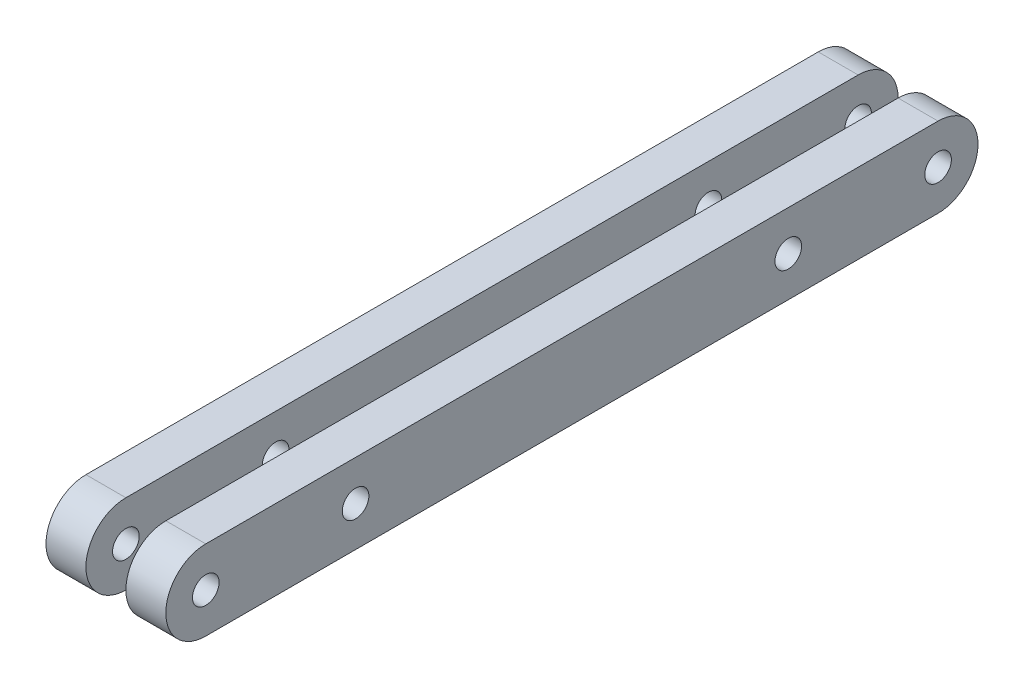
ISO-10303-21;
HEADER;
FILE_DESCRIPTION(('STEP AP214'),'2;1');
FILE_NAME('part.step','',(''),(''),'','','');
FILE_SCHEMA(('AUTOMOTIVE_DESIGN { 1 0 10303 214 1 1 1 1 }'));
ENDSEC;
DATA;
#1=APPLICATION_CONTEXT('core data for automotive mechanical design processes');
#2=APPLICATION_PROTOCOL_DEFINITION('international standard','automotive_design',2000,#1);
#3=PRODUCT_CONTEXT('',#1,'mechanical');
#4=PRODUCT('Part','Part','',(#3));
#5=PRODUCT_RELATED_PRODUCT_CATEGORY('part','',(#4));
#6=PRODUCT_DEFINITION_FORMATION('','',#4);
#7=PRODUCT_DEFINITION_CONTEXT('part definition',#1,'design');
#8=PRODUCT_DEFINITION('design','',#6,#7);
#9=PRODUCT_DEFINITION_SHAPE('','',#8);
#10=(LENGTH_UNIT() NAMED_UNIT(*) SI_UNIT(.MILLI.,.METRE.));
#11=(NAMED_UNIT(*) PLANE_ANGLE_UNIT() SI_UNIT($,.RADIAN.));
#12=(NAMED_UNIT(*) SI_UNIT($,.STERADIAN.) SOLID_ANGLE_UNIT());
#13=UNCERTAINTY_MEASURE_WITH_UNIT(LENGTH_MEASURE(1.E-05),#10,'distance_accuracy_value','');
#14=(GEOMETRIC_REPRESENTATION_CONTEXT(3) GLOBAL_UNCERTAINTY_ASSIGNED_CONTEXT((#13)) GLOBAL_UNIT_ASSIGNED_CONTEXT((#10,
#11,#12)) REPRESENTATION_CONTEXT('',''));
#15=CARTESIAN_POINT('',(0.,0.,0.));
#16=DIRECTION('',(0.,0.,1.));
#17=DIRECTION('',(1.,0.,0.));
#18=AXIS2_PLACEMENT_3D('',#15,#16,#17);
#19=CARTESIAN_POINT('',(-9.,0.,0.));
#20=DIRECTION('',(1.,0.,0.));
#21=DIRECTION('',(0.,0.,1.));
#22=AXIS2_PLACEMENT_3D('',#19,#20,#21);
#23=CYLINDRICAL_SURFACE('',#22,6.);
#24=CARTESIAN_POINT('',(-3.,0.,0.));
#25=DIRECTION('',(1.,0.,0.));
#26=DIRECTION('',(0.,0.,-1.));
#27=AXIS2_PLACEMENT_3D('',#24,#25,#26);
#28=CIRCLE('',#27,6.);
#29=CARTESIAN_POINT('',(-3.,6.,0.));
#30=VERTEX_POINT('',#29);
#31=CARTESIAN_POINT('',(-3.,-6.,0.));
#32=VERTEX_POINT('',#31);
#33=EDGE_CURVE('E116',#30,#32,#28,.T.);
#34=ORIENTED_EDGE('',*,*,#33,.F.);
#35=DIRECTION('',(1.,0.,0.));
#36=VECTOR('',#35,1.);
#37=CARTESIAN_POINT('',(-9.,6.,0.));
#38=LINE('',#37,#36);
#39=CARTESIAN_POINT('',(-9.,6.,0.));
#40=VERTEX_POINT('',#39);
#41=EDGE_CURVE('E115',#40,#30,#38,.T.);
#42=ORIENTED_EDGE('',*,*,#41,.F.);
#43=CARTESIAN_POINT('',(-9.,0.,0.));
#44=DIRECTION('',(1.,0.,0.));
#45=DIRECTION('',(0.,0.,-1.));
#46=AXIS2_PLACEMENT_3D('',#43,#44,#45);
#47=CIRCLE('',#46,6.);
#48=CARTESIAN_POINT('',(-9.,-6.,0.));
#49=VERTEX_POINT('',#48);
#50=EDGE_CURVE('E109',#40,#49,#47,.T.);
#51=ORIENTED_EDGE('',*,*,#50,.T.);
#52=DIRECTION('',(1.,0.,0.));
#53=VECTOR('',#52,1.);
#54=CARTESIAN_POINT('',(-9.,-6.,0.));
#55=LINE('',#54,#53);
#56=EDGE_CURVE('E12',#49,#32,#55,.T.);
#57=ORIENTED_EDGE('',*,*,#56,.T.);
#58=EDGE_LOOP('',(#34,#42,#51,#57));
#59=FACE_BOUND('',#58,.T.);
#60=ADVANCED_FACE('F49',(#59),#23,.T.);
#61=CARTESIAN_POINT('',(-9.,-6.,0.));
#62=DIRECTION('',(0.,1.,0.));
#63=DIRECTION('',(0.,0.,1.));
#64=AXIS2_PLACEMENT_3D('',#61,#62,#63);
#65=PLANE('',#64);
#66=DIRECTION('',(0.,0.,-1.));
#67=VECTOR('',#66,1.);
#68=CARTESIAN_POINT('',(-3.,-6.,0.));
#69=LINE('',#68,#67);
#70=CARTESIAN_POINT('',(-3.,-6.,-110.));
#71=VERTEX_POINT('',#70);
#72=EDGE_CURVE('E118',#32,#71,#69,.T.);
#73=ORIENTED_EDGE('',*,*,#72,.F.);
#74=ORIENTED_EDGE('',*,*,#56,.F.);
#75=DIRECTION('',(0.,0.,-1.));
#76=VECTOR('',#75,1.);
#77=CARTESIAN_POINT('',(-9.,-6.,0.));
#78=LINE('',#77,#76);
#79=CARTESIAN_POINT('',(-9.,-6.,-110.));
#80=VERTEX_POINT('',#79);
#81=EDGE_CURVE('E92',#49,#80,#78,.T.);
#82=ORIENTED_EDGE('',*,*,#81,.T.);
#83=DIRECTION('',(1.,0.,0.));
#84=VECTOR('',#83,1.);
#85=CARTESIAN_POINT('',(-9.,-6.,-110.));
#86=LINE('',#85,#84);
#87=EDGE_CURVE('E58',#80,#71,#86,.T.);
#88=ORIENTED_EDGE('',*,*,#87,.T.);
#89=EDGE_LOOP('',(#73,#74,#82,#88));
#90=FACE_BOUND('',#89,.T.);
#91=ADVANCED_FACE('F107',(#90),#65,.F.);
#92=CARTESIAN_POINT('',(-9.,0.,-110.));
#93=DIRECTION('',(1.,0.,0.));
#94=DIRECTION('',(0.,0.,1.));
#95=AXIS2_PLACEMENT_3D('',#92,#93,#94);
#96=CYLINDRICAL_SURFACE('',#95,6.);
#97=CARTESIAN_POINT('',(-3.,0.,-110.));
#98=DIRECTION('',(1.,0.,0.));
#99=DIRECTION('',(0.,0.,-1.));
#100=AXIS2_PLACEMENT_3D('',#97,#98,#99);
#101=CIRCLE('',#100,6.);
#102=CARTESIAN_POINT('',(-3.,6.,-110.));
#103=VERTEX_POINT('',#102);
#104=EDGE_CURVE('E102',#71,#103,#101,.T.);
#105=ORIENTED_EDGE('',*,*,#104,.F.);
#106=ORIENTED_EDGE('',*,*,#87,.F.);
#107=CARTESIAN_POINT('',(-9.,0.,-110.));
#108=DIRECTION('',(1.,0.,0.));
#109=DIRECTION('',(0.,0.,-1.));
#110=AXIS2_PLACEMENT_3D('',#107,#108,#109);
#111=CIRCLE('',#110,6.);
#112=CARTESIAN_POINT('',(-9.,6.,-110.));
#113=VERTEX_POINT('',#112);
#114=EDGE_CURVE('E95',#80,#113,#111,.T.);
#115=ORIENTED_EDGE('',*,*,#114,.T.);
#116=DIRECTION('',(1.,0.,0.));
#117=VECTOR('',#116,1.);
#118=CARTESIAN_POINT('',(-9.,6.,-110.));
#119=LINE('',#118,#117);
#120=EDGE_CURVE('E105',#113,#103,#119,.T.);
#121=ORIENTED_EDGE('',*,*,#120,.T.);
#122=EDGE_LOOP('',(#105,#106,#115,#121));
#123=FACE_BOUND('',#122,.T.);
#124=ADVANCED_FACE('F101',(#123),#96,.T.);
#125=CARTESIAN_POINT('',(-9.,6.,0.));
#126=DIRECTION('',(0.,1.,0.));
#127=DIRECTION('',(0.,0.,1.));
#128=AXIS2_PLACEMENT_3D('',#125,#126,#127);
#129=PLANE('',#128);
#130=DIRECTION('',(0.,0.,-1.));
#131=VECTOR('',#130,1.);
#132=CARTESIAN_POINT('',(-3.,6.,0.));
#133=LINE('',#132,#131);
#134=EDGE_CURVE('E81',#30,#103,#133,.T.);
#135=ORIENTED_EDGE('',*,*,#134,.T.);
#136=ORIENTED_EDGE('',*,*,#120,.F.);
#137=DIRECTION('',(0.,0.,-1.));
#138=VECTOR('',#137,1.);
#139=CARTESIAN_POINT('',(-9.,6.,0.));
#140=LINE('',#139,#138);
#141=EDGE_CURVE('E67',#40,#113,#140,.T.);
#142=ORIENTED_EDGE('',*,*,#141,.F.);
#143=ORIENTED_EDGE('',*,*,#41,.T.);
#144=EDGE_LOOP('',(#135,#136,#142,#143));
#145=FACE_BOUND('',#144,.T.);
#146=ADVANCED_FACE('F167',(#145),#129,.T.);
#147=CARTESIAN_POINT('',(-9.,0.,0.));
#148=DIRECTION('',(-1.,0.,0.));
#149=DIRECTION('',(0.,0.,-1.));
#150=AXIS2_PLACEMENT_3D('',#147,#148,#149);
#151=PLANE('',#150);
#152=CARTESIAN_POINT('',(-9.,0.,-87.5));
#153=DIRECTION('',(1.,0.,0.));
#154=DIRECTION('',(0.,0.,-1.));
#155=AXIS2_PLACEMENT_3D('',#152,#153,#154);
#156=CIRCLE('',#155,2.);
#157=CARTESIAN_POINT('',(-9.,0.,-89.5));
#158=VERTEX_POINT('',#157);
#159=EDGE_CURVE('E138',#158,#158,#156,.T.);
#160=ORIENTED_EDGE('',*,*,#159,.T.);
#161=EDGE_LOOP('',(#160));
#162=FACE_BOUND('',#161,.T.);
#163=CARTESIAN_POINT('',(-9.,0.,-22.5));
#164=DIRECTION('',(1.,0.,0.));
#165=DIRECTION('',(0.,0.,-1.));
#166=AXIS2_PLACEMENT_3D('',#163,#164,#165);
#167=CIRCLE('',#166,2.);
#168=CARTESIAN_POINT('',(-9.,0.,-24.5));
#169=VERTEX_POINT('',#168);
#170=EDGE_CURVE('E127',#169,#169,#167,.T.);
#171=ORIENTED_EDGE('',*,*,#170,.T.);
#172=EDGE_LOOP('',(#171));
#173=FACE_BOUND('',#172,.T.);
#174=CARTESIAN_POINT('',(-9.,0.,0.));
#175=DIRECTION('',(1.,0.,0.));
#176=DIRECTION('',(0.,0.,-1.));
#177=AXIS2_PLACEMENT_3D('',#174,#175,#176);
#178=CIRCLE('',#177,2.00000000000001);
#179=CARTESIAN_POINT('',(-9.,0.,-2.00000000000001));
#180=VERTEX_POINT('',#179);
#181=EDGE_CURVE('E119',#180,#180,#178,.T.);
#182=ORIENTED_EDGE('',*,*,#181,.T.);
#183=EDGE_LOOP('',(#182));
#184=FACE_BOUND('',#183,.T.);
#185=CARTESIAN_POINT('',(-9.,0.,-110.));
#186=DIRECTION('',(1.,0.,0.));
#187=DIRECTION('',(0.,0.,-1.));
#188=AXIS2_PLACEMENT_3D('',#185,#186,#187);
#189=CIRCLE('',#188,2.);
#190=CARTESIAN_POINT('',(-9.,0.,-112.));
#191=VERTEX_POINT('',#190);
#192=EDGE_CURVE('E142',#191,#191,#189,.T.);
#193=ORIENTED_EDGE('',*,*,#192,.T.);
#194=EDGE_LOOP('',(#193));
#195=FACE_BOUND('',#194,.T.);
#196=ORIENTED_EDGE('',*,*,#50,.F.);
#197=ORIENTED_EDGE('',*,*,#141,.T.);
#198=ORIENTED_EDGE('',*,*,#114,.F.);
#199=ORIENTED_EDGE('',*,*,#81,.F.);
#200=EDGE_LOOP('',(#196,#197,#198,#199));
#201=FACE_BOUND('',#200,.T.);
#202=ADVANCED_FACE('F97',(#162,#173,#184,#195,#201),#151,.T.);
#203=CARTESIAN_POINT('',(-3.,0.,0.));
#204=DIRECTION('',(-1.,0.,0.));
#205=DIRECTION('',(0.,0.,-1.));
#206=AXIS2_PLACEMENT_3D('',#203,#204,#205);
#207=PLANE('',#206);
#208=CARTESIAN_POINT('',(-3.,0.,-87.5));
#209=DIRECTION('',(-1.,0.,0.));
#210=DIRECTION('',(0.,0.,1.));
#211=AXIS2_PLACEMENT_3D('',#208,#209,#210);
#212=CIRCLE('',#211,2.);
#213=CARTESIAN_POINT('',(-3.,0.,-85.5));
#214=VERTEX_POINT('',#213);
#215=EDGE_CURVE('E52',#214,#214,#212,.T.);
#216=ORIENTED_EDGE('',*,*,#215,.T.);
#217=EDGE_LOOP('',(#216));
#218=FACE_BOUND('',#217,.T.);
#219=CARTESIAN_POINT('',(-3.,0.,-22.5));
#220=DIRECTION('',(-1.,0.,0.));
#221=DIRECTION('',(0.,0.,1.));
#222=AXIS2_PLACEMENT_3D('',#219,#220,#221);
#223=CIRCLE('',#222,2.);
#224=CARTESIAN_POINT('',(-3.,0.,-20.5));
#225=VERTEX_POINT('',#224);
#226=EDGE_CURVE('E124',#225,#225,#223,.T.);
#227=ORIENTED_EDGE('',*,*,#226,.T.);
#228=EDGE_LOOP('',(#227));
#229=FACE_BOUND('',#228,.T.);
#230=CARTESIAN_POINT('',(-3.,0.,0.));
#231=DIRECTION('',(1.,0.,0.));
#232=DIRECTION('',(0.,0.,-1.));
#233=AXIS2_PLACEMENT_3D('',#230,#231,#232);
#234=CIRCLE('',#233,2.00000000000001);
#235=CARTESIAN_POINT('',(-3.,0.,-2.00000000000001));
#236=VERTEX_POINT('',#235);
#237=EDGE_CURVE('E131',#236,#236,#234,.T.);
#238=ORIENTED_EDGE('',*,*,#237,.F.);
#239=EDGE_LOOP('',(#238));
#240=FACE_BOUND('',#239,.T.);
#241=CARTESIAN_POINT('',(-3.,0.,-110.));
#242=DIRECTION('',(1.,0.,0.));
#243=DIRECTION('',(0.,0.,-1.));
#244=AXIS2_PLACEMENT_3D('',#241,#242,#243);
#245=CIRCLE('',#244,2.);
#246=CARTESIAN_POINT('',(-3.,0.,-112.));
#247=VERTEX_POINT('',#246);
#248=EDGE_CURVE('E126',#247,#247,#245,.T.);
#249=ORIENTED_EDGE('',*,*,#248,.F.);
#250=EDGE_LOOP('',(#249));
#251=FACE_BOUND('',#250,.T.);
#252=ORIENTED_EDGE('',*,*,#33,.T.);
#253=ORIENTED_EDGE('',*,*,#72,.T.);
#254=ORIENTED_EDGE('',*,*,#104,.T.);
#255=ORIENTED_EDGE('',*,*,#134,.F.);
#256=EDGE_LOOP('',(#252,#253,#254,#255));
#257=FACE_BOUND('',#256,.T.);
#258=ADVANCED_FACE('F158',(#218,#229,#240,#251,#257),#207,.F.);
#259=CARTESIAN_POINT('',(-3.,0.,-110.));
#260=DIRECTION('',(-1.,0.,0.));
#261=DIRECTION('',(0.,0.,-1.));
#262=AXIS2_PLACEMENT_3D('',#259,#260,#261);
#263=CYLINDRICAL_SURFACE('',#262,2.);
#264=ORIENTED_EDGE('',*,*,#192,.F.);
#265=EDGE_LOOP('',(#264));
#266=FACE_BOUND('',#265,.T.);
#267=ORIENTED_EDGE('',*,*,#248,.T.);
#268=EDGE_LOOP('',(#267));
#269=FACE_BOUND('',#268,.T.);
#270=ADVANCED_FACE('F154',(#266,#269),#263,.F.);
#271=CARTESIAN_POINT('',(-3.,0.,0.));
#272=DIRECTION('',(-1.,0.,0.));
#273=DIRECTION('',(0.,0.,-1.));
#274=AXIS2_PLACEMENT_3D('',#271,#272,#273);
#275=CYLINDRICAL_SURFACE('',#274,2.00000000000001);
#276=ORIENTED_EDGE('',*,*,#181,.F.);
#277=EDGE_LOOP('',(#276));
#278=FACE_BOUND('',#277,.T.);
#279=ORIENTED_EDGE('',*,*,#237,.T.);
#280=EDGE_LOOP('',(#279));
#281=FACE_BOUND('',#280,.T.);
#282=ADVANCED_FACE('F150',(#278,#281),#275,.F.);
#283=CARTESIAN_POINT('',(9.,0.,-22.5));
#284=DIRECTION('',(1.,0.,0.));
#285=DIRECTION('',(0.,0.,-1.));
#286=AXIS2_PLACEMENT_3D('',#283,#284,#285);
#287=CYLINDRICAL_SURFACE('',#286,2.);
#288=ORIENTED_EDGE('',*,*,#170,.F.);
#289=EDGE_LOOP('',(#288));
#290=FACE_BOUND('',#289,.T.);
#291=ORIENTED_EDGE('',*,*,#226,.F.);
#292=EDGE_LOOP('',(#291));
#293=FACE_BOUND('',#292,.T.);
#294=ADVANCED_FACE('F153',(#290,#293),#287,.F.);
#295=CARTESIAN_POINT('',(9.,0.,-87.5));
#296=DIRECTION('',(1.,0.,0.));
#297=DIRECTION('',(0.,0.,-1.));
#298=AXIS2_PLACEMENT_3D('',#295,#296,#297);
#299=CYLINDRICAL_SURFACE('',#298,2.);
#300=ORIENTED_EDGE('',*,*,#159,.F.);
#301=EDGE_LOOP('',(#300));
#302=FACE_BOUND('',#301,.T.);
#303=ORIENTED_EDGE('',*,*,#215,.F.);
#304=EDGE_LOOP('',(#303));
#305=FACE_BOUND('',#304,.T.);
#306=ADVANCED_FACE('F230',(#302,#305),#299,.F.);
#307=CLOSED_SHELL('',(#60,#91,#124,#146,#202,#258,#270,#282,#294,#306));
#308=MANIFOLD_SOLID_BREP('B2',#307);
#309=CARTESIAN_POINT('',(9.,0.,0.));
#310=DIRECTION('',(-1.,0.,0.));
#311=DIRECTION('',(0.,0.,1.));
#312=AXIS2_PLACEMENT_3D('',#309,#310,#311);
#313=CYLINDRICAL_SURFACE('',#312,6.);
#314=CARTESIAN_POINT('',(3.,0.,0.));
#315=DIRECTION('',(1.,0.,0.));
#316=DIRECTION('',(0.,0.,-1.));
#317=AXIS2_PLACEMENT_3D('',#314,#315,#316);
#318=CIRCLE('',#317,6.);
#319=CARTESIAN_POINT('',(3.,6.,0.));
#320=VERTEX_POINT('',#319);
#321=CARTESIAN_POINT('',(3.,-6.,0.));
#322=VERTEX_POINT('',#321);
#323=EDGE_CURVE('E322',#320,#322,#318,.T.);
#324=ORIENTED_EDGE('',*,*,#323,.T.);
#325=DIRECTION('',(-1.,0.,0.));
#326=VECTOR('',#325,1.);
#327=CARTESIAN_POINT('',(9.,-6.,0.));
#328=LINE('',#327,#326);
#329=CARTESIAN_POINT('',(9.,-6.,0.));
#330=VERTEX_POINT('',#329);
#331=EDGE_CURVE('E47',#330,#322,#328,.T.);
#332=ORIENTED_EDGE('',*,*,#331,.F.);
#333=CARTESIAN_POINT('',(9.,0.,0.));
#334=DIRECTION('',(1.,0.,0.));
#335=DIRECTION('',(0.,0.,-1.));
#336=AXIS2_PLACEMENT_3D('',#333,#334,#335);
#337=CIRCLE('',#336,6.);
#338=CARTESIAN_POINT('',(9.,6.,0.));
#339=VERTEX_POINT('',#338);
#340=EDGE_CURVE('E307',#339,#330,#337,.T.);
#341=ORIENTED_EDGE('',*,*,#340,.F.);
#342=DIRECTION('',(-1.,0.,0.));
#343=VECTOR('',#342,1.);
#344=CARTESIAN_POINT('',(9.,6.,0.));
#345=LINE('',#344,#343);
#346=EDGE_CURVE('E274',#339,#320,#345,.T.);
#347=ORIENTED_EDGE('',*,*,#346,.T.);
#348=EDGE_LOOP('',(#324,#332,#341,#347));
#349=FACE_BOUND('',#348,.T.);
#350=ADVANCED_FACE('F257',(#349),#313,.T.);
#351=CARTESIAN_POINT('',(9.,-6.,0.));
#352=DIRECTION('',(0.,1.,0.));
#353=DIRECTION('',(0.,0.,1.));
#354=AXIS2_PLACEMENT_3D('',#351,#352,#353);
#355=PLANE('',#354);
#356=DIRECTION('',(0.,0.,-1.));
#357=VECTOR('',#356,1.);
#358=CARTESIAN_POINT('',(3.,-6.,0.));
#359=LINE('',#358,#357);
#360=CARTESIAN_POINT('',(3.,-6.,-110.));
#361=VERTEX_POINT('',#360);
#362=EDGE_CURVE('E312',#322,#361,#359,.T.);
#363=ORIENTED_EDGE('',*,*,#362,.T.);
#364=DIRECTION('',(-1.,0.,0.));
#365=VECTOR('',#364,1.);
#366=CARTESIAN_POINT('',(9.,-6.,-110.));
#367=LINE('',#366,#365);
#368=CARTESIAN_POINT('',(9.,-6.,-110.));
#369=VERTEX_POINT('',#368);
#370=EDGE_CURVE('E266',#369,#361,#367,.T.);
#371=ORIENTED_EDGE('',*,*,#370,.F.);
#372=DIRECTION('',(0.,0.,-1.));
#373=VECTOR('',#372,1.);
#374=CARTESIAN_POINT('',(9.,-6.,0.));
#375=LINE('',#374,#373);
#376=EDGE_CURVE('E300',#330,#369,#375,.T.);
#377=ORIENTED_EDGE('',*,*,#376,.F.);
#378=ORIENTED_EDGE('',*,*,#331,.T.);
#379=EDGE_LOOP('',(#363,#371,#377,#378));
#380=FACE_BOUND('',#379,.T.);
#381=ADVANCED_FACE('F311',(#380),#355,.F.);
#382=CARTESIAN_POINT('',(9.,0.,-110.));
#383=DIRECTION('',(-1.,0.,0.));
#384=DIRECTION('',(0.,0.,1.));
#385=AXIS2_PLACEMENT_3D('',#382,#383,#384);
#386=CYLINDRICAL_SURFACE('',#385,6.);
#387=CARTESIAN_POINT('',(3.,0.,-110.));
#388=DIRECTION('',(1.,0.,0.));
#389=DIRECTION('',(0.,0.,-1.));
#390=AXIS2_PLACEMENT_3D('',#387,#388,#389);
#391=CIRCLE('',#390,6.);
#392=CARTESIAN_POINT('',(3.,6.,-110.));
#393=VERTEX_POINT('',#392);
#394=EDGE_CURVE('E326',#361,#393,#391,.T.);
#395=ORIENTED_EDGE('',*,*,#394,.T.);
#396=DIRECTION('',(-1.,0.,0.));
#397=VECTOR('',#396,1.);
#398=CARTESIAN_POINT('',(9.,6.,-110.));
#399=LINE('',#398,#397);
#400=CARTESIAN_POINT('',(9.,6.,-110.));
#401=VERTEX_POINT('',#400);
#402=EDGE_CURVE('E289',#401,#393,#399,.T.);
#403=ORIENTED_EDGE('',*,*,#402,.F.);
#404=CARTESIAN_POINT('',(9.,0.,-110.));
#405=DIRECTION('',(1.,0.,0.));
#406=DIRECTION('',(0.,0.,-1.));
#407=AXIS2_PLACEMENT_3D('',#404,#405,#406);
#408=CIRCLE('',#407,6.);
#409=EDGE_CURVE('E306',#369,#401,#408,.T.);
#410=ORIENTED_EDGE('',*,*,#409,.F.);
#411=ORIENTED_EDGE('',*,*,#370,.T.);
#412=EDGE_LOOP('',(#395,#403,#410,#411));
#413=FACE_BOUND('',#412,.T.);
#414=ADVANCED_FACE('F316',(#413),#386,.T.);
#415=CARTESIAN_POINT('',(9.,6.,0.));
#416=DIRECTION('',(0.,1.,0.));
#417=DIRECTION('',(0.,0.,1.));
#418=AXIS2_PLACEMENT_3D('',#415,#416,#417);
#419=PLANE('',#418);
#420=DIRECTION('',(0.,0.,-1.));
#421=VECTOR('',#420,1.);
#422=CARTESIAN_POINT('',(3.,6.,0.));
#423=LINE('',#422,#421);
#424=EDGE_CURVE('E328',#320,#393,#423,.T.);
#425=ORIENTED_EDGE('',*,*,#424,.F.);
#426=ORIENTED_EDGE('',*,*,#346,.F.);
#427=DIRECTION('',(0.,0.,-1.));
#428=VECTOR('',#427,1.);
#429=CARTESIAN_POINT('',(9.,6.,0.));
#430=LINE('',#429,#428);
#431=EDGE_CURVE('E317',#339,#401,#430,.T.);
#432=ORIENTED_EDGE('',*,*,#431,.T.);
#433=ORIENTED_EDGE('',*,*,#402,.T.);
#434=EDGE_LOOP('',(#425,#426,#432,#433));
#435=FACE_BOUND('',#434,.T.);
#436=ADVANCED_FACE('F375',(#435),#419,.T.);
#437=CARTESIAN_POINT('',(9.,0.,0.));
#438=DIRECTION('',(1.,0.,0.));
#439=DIRECTION('',(0.,0.,-1.));
#440=AXIS2_PLACEMENT_3D('',#437,#438,#439);
#441=PLANE('',#440);
#442=CARTESIAN_POINT('',(9.,0.,-87.5));
#443=DIRECTION('',(1.,0.,0.));
#444=DIRECTION('',(0.,0.,-1.));
#445=AXIS2_PLACEMENT_3D('',#442,#443,#444);
#446=CIRCLE('',#445,2.);
#447=CARTESIAN_POINT('',(9.,0.,-89.5));
#448=VERTEX_POINT('',#447);
#449=EDGE_CURVE('E351',#448,#448,#446,.T.);
#450=ORIENTED_EDGE('',*,*,#449,.F.);
#451=EDGE_LOOP('',(#450));
#452=FACE_BOUND('',#451,.T.);
#453=CARTESIAN_POINT('',(9.,0.,-22.5));
#454=DIRECTION('',(1.,0.,0.));
#455=DIRECTION('',(0.,0.,-1.));
#456=AXIS2_PLACEMENT_3D('',#453,#454,#455);
#457=CIRCLE('',#456,2.);
#458=CARTESIAN_POINT('',(9.,0.,-24.5));
#459=VERTEX_POINT('',#458);
#460=EDGE_CURVE('E348',#459,#459,#457,.T.);
#461=ORIENTED_EDGE('',*,*,#460,.F.);
#462=EDGE_LOOP('',(#461));
#463=FACE_BOUND('',#462,.T.);
#464=CARTESIAN_POINT('',(9.,0.,0.));
#465=DIRECTION('',(1.,0.,0.));
#466=DIRECTION('',(0.,0.,-1.));
#467=AXIS2_PLACEMENT_3D('',#464,#465,#466);
#468=CIRCLE('',#467,2.00000000000001);
#469=CARTESIAN_POINT('',(9.,0.,-2.00000000000001));
#470=VERTEX_POINT('',#469);
#471=EDGE_CURVE('E324',#470,#470,#468,.T.);
#472=ORIENTED_EDGE('',*,*,#471,.F.);
#473=EDGE_LOOP('',(#472));
#474=FACE_BOUND('',#473,.T.);
#475=CARTESIAN_POINT('',(9.,0.,-110.));
#476=DIRECTION('',(1.,0.,0.));
#477=DIRECTION('',(0.,0.,-1.));
#478=AXIS2_PLACEMENT_3D('',#475,#476,#477);
#479=CIRCLE('',#478,2.);
#480=CARTESIAN_POINT('',(9.,0.,-112.));
#481=VERTEX_POINT('',#480);
#482=EDGE_CURVE('E336',#481,#481,#479,.T.);
#483=ORIENTED_EDGE('',*,*,#482,.F.);
#484=EDGE_LOOP('',(#483));
#485=FACE_BOUND('',#484,.T.);
#486=ORIENTED_EDGE('',*,*,#340,.T.);
#487=ORIENTED_EDGE('',*,*,#376,.T.);
#488=ORIENTED_EDGE('',*,*,#409,.T.);
#489=ORIENTED_EDGE('',*,*,#431,.F.);
#490=EDGE_LOOP('',(#486,#487,#488,#489));
#491=FACE_BOUND('',#490,.T.);
#492=ADVANCED_FACE('F303',(#452,#463,#474,#485,#491),#441,.T.);
#493=CARTESIAN_POINT('',(3.,0.,0.));
#494=DIRECTION('',(1.,0.,0.));
#495=DIRECTION('',(0.,0.,-1.));
#496=AXIS2_PLACEMENT_3D('',#493,#494,#495);
#497=PLANE('',#496);
#498=CARTESIAN_POINT('',(3.,0.,-87.5));
#499=DIRECTION('',(1.,0.,0.));
#500=DIRECTION('',(0.,0.,-1.));
#501=AXIS2_PLACEMENT_3D('',#498,#499,#500);
#502=CIRCLE('',#501,2.);
#503=CARTESIAN_POINT('',(3.,0.,-89.5));
#504=VERTEX_POINT('',#503);
#505=EDGE_CURVE('E260',#504,#504,#502,.T.);
#506=ORIENTED_EDGE('',*,*,#505,.T.);
#507=EDGE_LOOP('',(#506));
#508=FACE_BOUND('',#507,.T.);
#509=CARTESIAN_POINT('',(3.,0.,-22.5));
#510=DIRECTION('',(1.,0.,0.));
#511=DIRECTION('',(0.,0.,-1.));
#512=AXIS2_PLACEMENT_3D('',#509,#510,#511);
#513=CIRCLE('',#512,2.);
#514=CARTESIAN_POINT('',(3.,0.,-24.5));
#515=VERTEX_POINT('',#514);
#516=EDGE_CURVE('E343',#515,#515,#513,.T.);
#517=ORIENTED_EDGE('',*,*,#516,.T.);
#518=EDGE_LOOP('',(#517));
#519=FACE_BOUND('',#518,.T.);
#520=CARTESIAN_POINT('',(3.,0.,0.));
#521=DIRECTION('',(1.,0.,0.));
#522=DIRECTION('',(0.,0.,-1.));
#523=AXIS2_PLACEMENT_3D('',#520,#521,#522);
#524=CIRCLE('',#523,2.00000000000001);
#525=CARTESIAN_POINT('',(3.,0.,-2.00000000000001));
#526=VERTEX_POINT('',#525);
#527=EDGE_CURVE('E339',#526,#526,#524,.T.);
#528=ORIENTED_EDGE('',*,*,#527,.T.);
#529=EDGE_LOOP('',(#528));
#530=FACE_BOUND('',#529,.T.);
#531=CARTESIAN_POINT('',(3.,0.,-110.));
#532=DIRECTION('',(1.,0.,0.));
#533=DIRECTION('',(0.,0.,-1.));
#534=AXIS2_PLACEMENT_3D('',#531,#532,#533);
#535=CIRCLE('',#534,2.);
#536=CARTESIAN_POINT('',(3.,0.,-112.));
#537=VERTEX_POINT('',#536);
#538=EDGE_CURVE('E340',#537,#537,#535,.T.);
#539=ORIENTED_EDGE('',*,*,#538,.T.);
#540=EDGE_LOOP('',(#539));
#541=FACE_BOUND('',#540,.T.);
#542=ORIENTED_EDGE('',*,*,#323,.F.);
#543=ORIENTED_EDGE('',*,*,#424,.T.);
#544=ORIENTED_EDGE('',*,*,#394,.F.);
#545=ORIENTED_EDGE('',*,*,#362,.F.);
#546=EDGE_LOOP('',(#542,#543,#544,#545));
#547=FACE_BOUND('',#546,.T.);
#548=ADVANCED_FACE('F358',(#508,#519,#530,#541,#547),#497,.F.);
#549=CARTESIAN_POINT('',(3.,0.,-110.));
#550=DIRECTION('',(1.,0.,0.));
#551=DIRECTION('',(0.,0.,-1.));
#552=AXIS2_PLACEMENT_3D('',#549,#550,#551);
#553=CYLINDRICAL_SURFACE('',#552,2.);
#554=ORIENTED_EDGE('',*,*,#482,.T.);
#555=EDGE_LOOP('',(#554));
#556=FACE_BOUND('',#555,.T.);
#557=ORIENTED_EDGE('',*,*,#538,.F.);
#558=EDGE_LOOP('',(#557));
#559=FACE_BOUND('',#558,.T.);
#560=ADVANCED_FACE('F388',(#556,#559),#553,.F.);
#561=CARTESIAN_POINT('',(3.,0.,0.));
#562=DIRECTION('',(1.,0.,0.));
#563=DIRECTION('',(0.,0.,-1.));
#564=AXIS2_PLACEMENT_3D('',#561,#562,#563);
#565=CYLINDRICAL_SURFACE('',#564,2.00000000000001);
#566=ORIENTED_EDGE('',*,*,#471,.T.);
#567=EDGE_LOOP('',(#566));
#568=FACE_BOUND('',#567,.T.);
#569=ORIENTED_EDGE('',*,*,#527,.F.);
#570=EDGE_LOOP('',(#569));
#571=FACE_BOUND('',#570,.T.);
#572=ADVANCED_FACE('F368',(#568,#571),#565,.F.);
#573=CARTESIAN_POINT('',(9.,0.,-22.5));
#574=DIRECTION('',(1.,0.,0.));
#575=DIRECTION('',(0.,0.,-1.));
#576=AXIS2_PLACEMENT_3D('',#573,#574,#575);
#577=CYLINDRICAL_SURFACE('',#576,2.);
#578=ORIENTED_EDGE('',*,*,#460,.T.);
#579=EDGE_LOOP('',(#578));
#580=FACE_BOUND('',#579,.T.);
#581=ORIENTED_EDGE('',*,*,#516,.F.);
#582=EDGE_LOOP('',(#581));
#583=FACE_BOUND('',#582,.T.);
#584=ADVANCED_FACE('F363',(#580,#583),#577,.F.);
#585=CARTESIAN_POINT('',(9.,0.,-87.5));
#586=DIRECTION('',(1.,0.,0.));
#587=DIRECTION('',(0.,0.,-1.));
#588=AXIS2_PLACEMENT_3D('',#585,#586,#587);
#589=CYLINDRICAL_SURFACE('',#588,2.);
#590=ORIENTED_EDGE('',*,*,#449,.T.);
#591=EDGE_LOOP('',(#590));
#592=FACE_BOUND('',#591,.T.);
#593=ORIENTED_EDGE('',*,*,#505,.F.);
#594=EDGE_LOOP('',(#593));
#595=FACE_BOUND('',#594,.T.);
#596=ADVANCED_FACE('F361',(#592,#595),#589,.F.);
#597=CLOSED_SHELL('',(#350,#381,#414,#436,#492,#548,#560,#572,#584,#596));
#598=MANIFOLD_SOLID_BREP('B6',#597);
#599=ADVANCED_BREP_SHAPE_REPRESENTATION('',(#18,#308,#598),#14);
#600=SHAPE_DEFINITION_REPRESENTATION(#9,#599);
ENDSEC;
END-ISO-10303-21;
